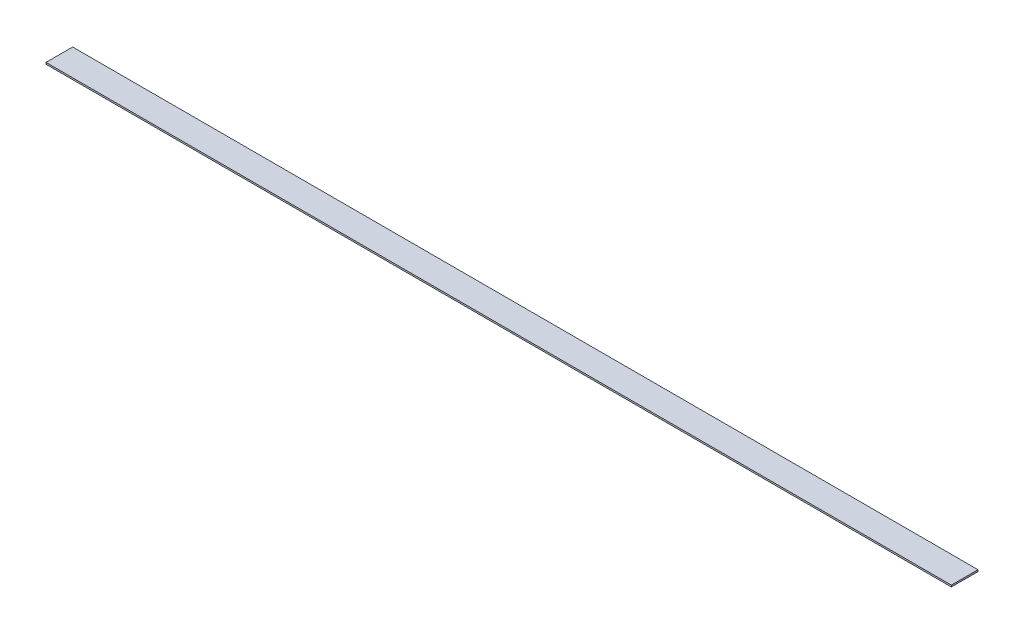
ISO-10303-21;
HEADER;
FILE_DESCRIPTION(('STEP AP214'),'2;1');
FILE_NAME('part.step','',(''),(''),'','','');
FILE_SCHEMA(('AUTOMOTIVE_DESIGN { 1 0 10303 214 1 1 1 1 }'));
ENDSEC;
DATA;
#1=APPLICATION_CONTEXT('core data for automotive mechanical design processes');
#2=APPLICATION_PROTOCOL_DEFINITION('international standard','automotive_design',2000,#1);
#3=PRODUCT_CONTEXT('',#1,'mechanical');
#4=PRODUCT('Part','Part','',(#3));
#5=PRODUCT_RELATED_PRODUCT_CATEGORY('part','',(#4));
#6=PRODUCT_DEFINITION_FORMATION('','',#4);
#7=PRODUCT_DEFINITION_CONTEXT('part definition',#1,'design');
#8=PRODUCT_DEFINITION('design','',#6,#7);
#9=PRODUCT_DEFINITION_SHAPE('','',#8);
#10=(LENGTH_UNIT() NAMED_UNIT(*) SI_UNIT(.MILLI.,.METRE.));
#11=(NAMED_UNIT(*) PLANE_ANGLE_UNIT() SI_UNIT($,.RADIAN.));
#12=(NAMED_UNIT(*) SI_UNIT($,.STERADIAN.) SOLID_ANGLE_UNIT());
#13=UNCERTAINTY_MEASURE_WITH_UNIT(LENGTH_MEASURE(1.E-05),#10,'distance_accuracy_value','');
#14=(GEOMETRIC_REPRESENTATION_CONTEXT(3) GLOBAL_UNCERTAINTY_ASSIGNED_CONTEXT((#13)) GLOBAL_UNIT_ASSIGNED_CONTEXT((#10,
#11,#12)) REPRESENTATION_CONTEXT('',''));
#15=CARTESIAN_POINT('',(0.,0.,0.));
#16=DIRECTION('',(0.,0.,1.));
#17=DIRECTION('',(1.,0.,0.));
#18=AXIS2_PLACEMENT_3D('',#15,#16,#17);
#19=CARTESIAN_POINT('',(0.,1.5875,0.));
#20=DIRECTION('',(1.,0.,0.));
#21=DIRECTION('',(0.,0.,-1.));
#22=AXIS2_PLACEMENT_3D('',#19,#20,#21);
#23=PLANE('',#22);
#24=DIRECTION('',(0.,0.,1.));
#25=VECTOR('',#24,1.);
#26=CARTESIAN_POINT('',(0.,0.,0.));
#27=LINE('',#26,#25);
#28=CARTESIAN_POINT('',(0.,0.,-25.4));
#29=VERTEX_POINT('',#28);
#30=CARTESIAN_POINT('',(0.,0.,0.));
#31=VERTEX_POINT('',#30);
#32=EDGE_CURVE('E95',#29,#31,#27,.T.);
#33=ORIENTED_EDGE('',*,*,#32,.T.);
#34=DIRECTION('',(0.,-1.,0.));
#35=VECTOR('',#34,1.);
#36=CARTESIAN_POINT('',(0.,1.5875,0.));
#37=LINE('',#36,#35);
#38=CARTESIAN_POINT('',(0.,1.5875,0.));
#39=VERTEX_POINT('',#38);
#40=EDGE_CURVE('E11',#39,#31,#37,.T.);
#41=ORIENTED_EDGE('',*,*,#40,.F.);
#42=DIRECTION('',(0.,0.,1.));
#43=VECTOR('',#42,1.);
#44=CARTESIAN_POINT('',(0.,1.5875,0.));
#45=LINE('',#44,#43);
#46=CARTESIAN_POINT('',(0.,1.5875,-25.4));
#47=VERTEX_POINT('',#46);
#48=EDGE_CURVE('E83',#47,#39,#45,.T.);
#49=ORIENTED_EDGE('',*,*,#48,.F.);
#50=DIRECTION('',(0.,-1.,0.));
#51=VECTOR('',#50,1.);
#52=CARTESIAN_POINT('',(0.,1.5875,-25.4));
#53=LINE('',#52,#51);
#54=EDGE_CURVE('E91',#47,#29,#53,.T.);
#55=ORIENTED_EDGE('',*,*,#54,.T.);
#56=EDGE_LOOP('',(#33,#41,#49,#55));
#57=FACE_BOUND('',#56,.T.);
#58=ADVANCED_FACE('F32',(#57),#23,.F.);
#59=CARTESIAN_POINT('',(0.,1.5875,0.));
#60=DIRECTION('',(0.,0.,-1.));
#61=DIRECTION('',(-1.,0.,0.));
#62=AXIS2_PLACEMENT_3D('',#59,#60,#61);
#63=PLANE('',#62);
#64=DIRECTION('',(1.,0.,0.));
#65=VECTOR('',#64,1.);
#66=CARTESIAN_POINT('',(0.,0.,0.));
#67=LINE('',#66,#65);
#68=CARTESIAN_POINT('',(863.6,0.,0.));
#69=VERTEX_POINT('',#68);
#70=EDGE_CURVE('E87',#31,#69,#67,.T.);
#71=ORIENTED_EDGE('',*,*,#70,.T.);
#72=DIRECTION('',(0.,-1.,0.));
#73=VECTOR('',#72,1.);
#74=CARTESIAN_POINT('',(863.6,1.5875,0.));
#75=LINE('',#74,#73);
#76=CARTESIAN_POINT('',(863.6,1.5875,0.));
#77=VERTEX_POINT('',#76);
#78=EDGE_CURVE('E40',#77,#69,#75,.T.);
#79=ORIENTED_EDGE('',*,*,#78,.F.);
#80=DIRECTION('',(1.,0.,0.));
#81=VECTOR('',#80,1.);
#82=CARTESIAN_POINT('',(0.,1.5875,0.));
#83=LINE('',#82,#81);
#84=EDGE_CURVE('E78',#39,#77,#83,.T.);
#85=ORIENTED_EDGE('',*,*,#84,.F.);
#86=ORIENTED_EDGE('',*,*,#40,.T.);
#87=EDGE_LOOP('',(#71,#79,#85,#86));
#88=FACE_BOUND('',#87,.T.);
#89=ADVANCED_FACE('F86',(#88),#63,.F.);
#90=CARTESIAN_POINT('',(863.6,1.5875,0.));
#91=DIRECTION('',(-1.,0.,0.));
#92=DIRECTION('',(0.,0.,1.));
#93=AXIS2_PLACEMENT_3D('',#90,#91,#92);
#94=PLANE('',#93);
#95=DIRECTION('',(0.,0.,-1.));
#96=VECTOR('',#95,1.);
#97=CARTESIAN_POINT('',(863.6,0.,0.));
#98=LINE('',#97,#96);
#99=CARTESIAN_POINT('',(863.6,0.,-25.4));
#100=VERTEX_POINT('',#99);
#101=EDGE_CURVE('E65',#69,#100,#98,.T.);
#102=ORIENTED_EDGE('',*,*,#101,.T.);
#103=DIRECTION('',(0.,-1.,0.));
#104=VECTOR('',#103,1.);
#105=CARTESIAN_POINT('',(863.6,1.5875,-25.4));
#106=LINE('',#105,#104);
#107=CARTESIAN_POINT('',(863.6,1.5875,-25.4));
#108=VERTEX_POINT('',#107);
#109=EDGE_CURVE('E88',#108,#100,#106,.T.);
#110=ORIENTED_EDGE('',*,*,#109,.F.);
#111=DIRECTION('',(0.,0.,-1.));
#112=VECTOR('',#111,1.);
#113=CARTESIAN_POINT('',(863.6,1.5875,0.));
#114=LINE('',#113,#112);
#115=EDGE_CURVE('E81',#77,#108,#114,.T.);
#116=ORIENTED_EDGE('',*,*,#115,.F.);
#117=ORIENTED_EDGE('',*,*,#78,.T.);
#118=EDGE_LOOP('',(#102,#110,#116,#117));
#119=FACE_BOUND('',#118,.T.);
#120=ADVANCED_FACE('F89',(#119),#94,.F.);
#121=CARTESIAN_POINT('',(0.,1.5875,-25.4));
#122=DIRECTION('',(0.,0.,1.));
#123=DIRECTION('',(1.,0.,0.));
#124=AXIS2_PLACEMENT_3D('',#121,#122,#123);
#125=PLANE('',#124);
#126=DIRECTION('',(-1.,0.,0.));
#127=VECTOR('',#126,1.);
#128=CARTESIAN_POINT('',(0.,0.,-25.4));
#129=LINE('',#128,#127);
#130=EDGE_CURVE('E71',#100,#29,#129,.T.);
#131=ORIENTED_EDGE('',*,*,#130,.T.);
#132=ORIENTED_EDGE('',*,*,#54,.F.);
#133=DIRECTION('',(-1.,0.,0.));
#134=VECTOR('',#133,1.);
#135=CARTESIAN_POINT('',(0.,1.5875,-25.4));
#136=LINE('',#135,#134);
#137=EDGE_CURVE('E48',#108,#47,#136,.T.);
#138=ORIENTED_EDGE('',*,*,#137,.F.);
#139=ORIENTED_EDGE('',*,*,#109,.T.);
#140=EDGE_LOOP('',(#131,#132,#138,#139));
#141=FACE_BOUND('',#140,.T.);
#142=ADVANCED_FACE('F102',(#141),#125,.F.);
#143=CARTESIAN_POINT('',(0.,1.5875,0.));
#144=DIRECTION('',(0.,-1.,0.));
#145=DIRECTION('',(0.,0.,-1.));
#146=AXIS2_PLACEMENT_3D('',#143,#144,#145);
#147=PLANE('',#146);
#148=ORIENTED_EDGE('',*,*,#48,.T.);
#149=ORIENTED_EDGE('',*,*,#84,.T.);
#150=ORIENTED_EDGE('',*,*,#115,.T.);
#151=ORIENTED_EDGE('',*,*,#137,.T.);
#152=EDGE_LOOP('',(#148,#149,#150,#151));
#153=FACE_BOUND('',#152,.T.);
#154=ADVANCED_FACE('F79',(#153),#147,.F.);
#155=CARTESIAN_POINT('',(0.,0.,0.));
#156=DIRECTION('',(0.,-1.,0.));
#157=DIRECTION('',(0.,0.,-1.));
#158=AXIS2_PLACEMENT_3D('',#155,#156,#157);
#159=PLANE('',#158);
#160=ORIENTED_EDGE('',*,*,#32,.F.);
#161=ORIENTED_EDGE('',*,*,#130,.F.);
#162=ORIENTED_EDGE('',*,*,#101,.F.);
#163=ORIENTED_EDGE('',*,*,#70,.F.);
#164=EDGE_LOOP('',(#160,#161,#162,#163));
#165=FACE_BOUND('',#164,.T.);
#166=ADVANCED_FACE('F105',(#165),#159,.T.);
#167=CLOSED_SHELL('',(#58,#89,#120,#142,#154,#166));
#168=MANIFOLD_SOLID_BREP('B2',#167);
#169=ADVANCED_BREP_SHAPE_REPRESENTATION('',(#18,#168),#14);
#170=SHAPE_DEFINITION_REPRESENTATION(#9,#169);
ENDSEC;
END-ISO-10303-21;
